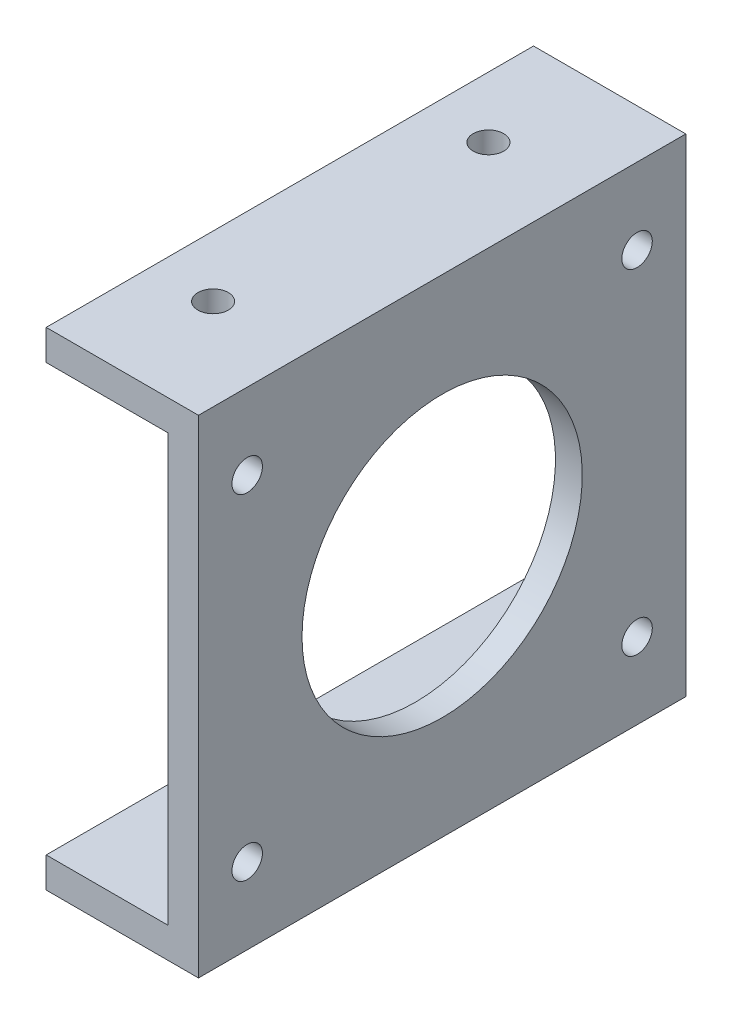
ISO-10303-21;
HEADER;
FILE_DESCRIPTION(('STEP AP214'),'2;1');
FILE_NAME('part.step','',(''),(''),'','','');
FILE_SCHEMA(('AUTOMOTIVE_DESIGN { 1 0 10303 214 1 1 1 1 }'));
ENDSEC;
DATA;
#1=APPLICATION_CONTEXT('core data for automotive mechanical design processes');
#2=APPLICATION_PROTOCOL_DEFINITION('international standard','automotive_design',2000,#1);
#3=PRODUCT_CONTEXT('',#1,'mechanical');
#4=PRODUCT('Part','Part','',(#3));
#5=PRODUCT_RELATED_PRODUCT_CATEGORY('part','',(#4));
#6=PRODUCT_DEFINITION_FORMATION('','',#4);
#7=PRODUCT_DEFINITION_CONTEXT('part definition',#1,'design');
#8=PRODUCT_DEFINITION('design','',#6,#7);
#9=PRODUCT_DEFINITION_SHAPE('','',#8);
#10=(LENGTH_UNIT() NAMED_UNIT(*) SI_UNIT(.MILLI.,.METRE.));
#11=(NAMED_UNIT(*) PLANE_ANGLE_UNIT() SI_UNIT($,.RADIAN.));
#12=(NAMED_UNIT(*) SI_UNIT($,.STERADIAN.) SOLID_ANGLE_UNIT());
#13=UNCERTAINTY_MEASURE_WITH_UNIT(LENGTH_MEASURE(1.E-05),#10,'distance_accuracy_value','');
#14=(GEOMETRIC_REPRESENTATION_CONTEXT(3) GLOBAL_UNCERTAINTY_ASSIGNED_CONTEXT((#13)) GLOBAL_UNIT_ASSIGNED_CONTEXT((#10,
#11,#12)) REPRESENTATION_CONTEXT('',''));
#15=CARTESIAN_POINT('',(0.,0.,0.));
#16=DIRECTION('',(0.,0.,1.));
#17=DIRECTION('',(1.,0.,0.));
#18=AXIS2_PLACEMENT_3D('',#15,#16,#17);
#19=CARTESIAN_POINT('',(0.,40.,80.));
#20=DIRECTION('',(1.,0.,0.));
#21=DIRECTION('',(0.,0.,-1.));
#22=AXIS2_PLACEMENT_3D('',#19,#20,#21);
#23=PLANE('',#22);
#24=DIRECTION('',(0.,-1.,0.));
#25=VECTOR('',#24,1.);
#26=CARTESIAN_POINT('',(0.,40.,0.));
#27=LINE('',#26,#25);
#28=CARTESIAN_POINT('',(0.,40.,0.));
#29=VERTEX_POINT('',#28);
#30=CARTESIAN_POINT('',(0.,35.,0.));
#31=VERTEX_POINT('',#30);
#32=EDGE_CURVE('E142',#29,#31,#27,.T.);
#33=ORIENTED_EDGE('',*,*,#32,.T.);
#34=DIRECTION('',(0.,0.,-1.));
#35=VECTOR('',#34,1.);
#36=CARTESIAN_POINT('',(0.,35.,80.));
#37=LINE('',#36,#35);
#38=CARTESIAN_POINT('',(0.,35.,80.));
#39=VERTEX_POINT('',#38);
#40=EDGE_CURVE('E49',#39,#31,#37,.T.);
#41=ORIENTED_EDGE('',*,*,#40,.F.);
#42=DIRECTION('',(0.,-1.,0.));
#43=VECTOR('',#42,1.);
#44=CARTESIAN_POINT('',(0.,40.,80.));
#45=LINE('',#44,#43);
#46=CARTESIAN_POINT('',(0.,40.,80.));
#47=VERTEX_POINT('',#46);
#48=EDGE_CURVE('E165',#47,#39,#45,.T.);
#49=ORIENTED_EDGE('',*,*,#48,.F.);
#50=DIRECTION('',(0.,0.,-1.));
#51=VECTOR('',#50,1.);
#52=CARTESIAN_POINT('',(0.,40.,80.));
#53=LINE('',#52,#51);
#54=EDGE_CURVE('E138',#47,#29,#53,.T.);
#55=ORIENTED_EDGE('',*,*,#54,.T.);
#56=EDGE_LOOP('',(#33,#41,#49,#55));
#57=FACE_BOUND('',#56,.T.);
#58=ADVANCED_FACE('F38',(#57),#23,.F.);
#59=CARTESIAN_POINT('',(0.,35.,80.));
#60=DIRECTION('',(0.,1.,0.));
#61=DIRECTION('',(0.,0.,1.));
#62=AXIS2_PLACEMENT_3D('',#59,#60,#61);
#63=PLANE('',#62);
#64=CARTESIAN_POINT('',(9.99999999999999,35.,17.4));
#65=DIRECTION('',(0.,1.,0.));
#66=DIRECTION('',(0.,0.,1.));
#67=AXIS2_PLACEMENT_3D('',#64,#65,#66);
#68=CIRCLE('',#67,2.49999999999999);
#69=CARTESIAN_POINT('',(9.99999999999999,35.,19.9));
#70=VERTEX_POINT('',#69);
#71=EDGE_CURVE('E238',#70,#70,#68,.T.);
#72=ORIENTED_EDGE('',*,*,#71,.T.);
#73=EDGE_LOOP('',(#72));
#74=FACE_BOUND('',#73,.T.);
#75=CARTESIAN_POINT('',(9.99999999999999,35.,62.6));
#76=DIRECTION('',(0.,1.,0.));
#77=DIRECTION('',(0.,0.,1.));
#78=AXIS2_PLACEMENT_3D('',#75,#76,#77);
#79=CIRCLE('',#78,2.49999999999999);
#80=CARTESIAN_POINT('',(9.99999999999999,35.,65.1));
#81=VERTEX_POINT('',#80);
#82=EDGE_CURVE('E42',#81,#81,#79,.T.);
#83=ORIENTED_EDGE('',*,*,#82,.T.);
#84=EDGE_LOOP('',(#83));
#85=FACE_BOUND('',#84,.T.);
#86=DIRECTION('',(1.,0.,0.));
#87=VECTOR('',#86,1.);
#88=CARTESIAN_POINT('',(0.,35.,0.));
#89=LINE('',#88,#87);
#90=CARTESIAN_POINT('',(20.,35.,0.));
#91=VERTEX_POINT('',#90);
#92=EDGE_CURVE('E146',#31,#91,#89,.T.);
#93=ORIENTED_EDGE('',*,*,#92,.T.);
#94=DIRECTION('',(0.,0.,-1.));
#95=VECTOR('',#94,1.);
#96=CARTESIAN_POINT('',(20.,35.,80.));
#97=LINE('',#96,#95);
#98=CARTESIAN_POINT('',(20.,35.,80.));
#99=VERTEX_POINT('',#98);
#100=EDGE_CURVE('E180',#99,#91,#97,.T.);
#101=ORIENTED_EDGE('',*,*,#100,.F.);
#102=DIRECTION('',(1.,0.,0.));
#103=VECTOR('',#102,1.);
#104=CARTESIAN_POINT('',(0.,35.,80.));
#105=LINE('',#104,#103);
#106=EDGE_CURVE('E101',#39,#99,#105,.T.);
#107=ORIENTED_EDGE('',*,*,#106,.F.);
#108=ORIENTED_EDGE('',*,*,#40,.T.);
#109=EDGE_LOOP('',(#93,#101,#107,#108));
#110=FACE_BOUND('',#109,.T.);
#111=ADVANCED_FACE('F186',(#74,#85,#110),#63,.F.);
#112=CARTESIAN_POINT('',(20.,35.,80.));
#113=DIRECTION('',(1.,0.,0.));
#114=DIRECTION('',(0.,1.,0.));
#115=AXIS2_PLACEMENT_3D('',#112,#113,#114);
#116=PLANE('',#115);
#117=CARTESIAN_POINT('',(20.,27.5,72.));
#118=DIRECTION('',(1.,0.,0.));
#119=DIRECTION('',(0.,1.,0.));
#120=AXIS2_PLACEMENT_3D('',#117,#118,#119);
#121=CIRCLE('',#120,2.49999999999999);
#122=CARTESIAN_POINT('',(20.,30.,72.));
#123=VERTEX_POINT('',#122);
#124=EDGE_CURVE('E278',#123,#123,#121,.T.);
#125=ORIENTED_EDGE('',*,*,#124,.T.);
#126=EDGE_LOOP('',(#125));
#127=FACE_BOUND('',#126,.T.);
#128=CARTESIAN_POINT('',(20.,27.5,8.));
#129=DIRECTION('',(1.,0.,0.));
#130=DIRECTION('',(0.,1.,0.));
#131=AXIS2_PLACEMENT_3D('',#128,#129,#130);
#132=CIRCLE('',#131,2.49999999999999);
#133=CARTESIAN_POINT('',(20.,30.,8.));
#134=VERTEX_POINT('',#133);
#135=EDGE_CURVE('E270',#134,#134,#132,.T.);
#136=ORIENTED_EDGE('',*,*,#135,.T.);
#137=EDGE_LOOP('',(#136));
#138=FACE_BOUND('',#137,.T.);
#139=CARTESIAN_POINT('',(20.,-27.5,7.99999999999999));
#140=DIRECTION('',(1.,0.,0.));
#141=DIRECTION('',(0.,1.,0.));
#142=AXIS2_PLACEMENT_3D('',#139,#140,#141);
#143=CIRCLE('',#142,2.49999999999999);
#144=CARTESIAN_POINT('',(20.,-25.,7.99999999999999));
#145=VERTEX_POINT('',#144);
#146=EDGE_CURVE('E262',#145,#145,#143,.T.);
#147=ORIENTED_EDGE('',*,*,#146,.T.);
#148=EDGE_LOOP('',(#147));
#149=FACE_BOUND('',#148,.T.);
#150=CARTESIAN_POINT('',(20.,-27.5,72.));
#151=DIRECTION('',(1.,0.,0.));
#152=DIRECTION('',(0.,1.,0.));
#153=AXIS2_PLACEMENT_3D('',#150,#151,#152);
#154=CIRCLE('',#153,2.49999999999999);
#155=CARTESIAN_POINT('',(20.,-25.,72.));
#156=VERTEX_POINT('',#155);
#157=EDGE_CURVE('E254',#156,#156,#154,.T.);
#158=ORIENTED_EDGE('',*,*,#157,.T.);
#159=EDGE_LOOP('',(#158));
#160=FACE_BOUND('',#159,.T.);
#161=CARTESIAN_POINT('',(20.,0.,40.));
#162=DIRECTION('',(-1.,0.,0.));
#163=DIRECTION('',(0.,-1.,0.));
#164=AXIS2_PLACEMENT_3D('',#161,#162,#163);
#165=CIRCLE('',#164,26.);
#166=CARTESIAN_POINT('',(20.,-26.,40.));
#167=VERTEX_POINT('',#166);
#168=EDGE_CURVE('E147',#167,#167,#165,.T.);
#169=ORIENTED_EDGE('',*,*,#168,.F.);
#170=EDGE_LOOP('',(#169));
#171=FACE_BOUND('',#170,.T.);
#172=DIRECTION('',(0.,-1.,0.));
#173=VECTOR('',#172,1.);
#174=CARTESIAN_POINT('',(20.,35.,0.));
#175=LINE('',#174,#173);
#176=CARTESIAN_POINT('',(20.,-35.,0.));
#177=VERTEX_POINT('',#176);
#178=EDGE_CURVE('E150',#91,#177,#175,.T.);
#179=ORIENTED_EDGE('',*,*,#178,.T.);
#180=DIRECTION('',(0.,0.,-1.));
#181=VECTOR('',#180,1.);
#182=CARTESIAN_POINT('',(20.,-35.,80.));
#183=LINE('',#182,#181);
#184=CARTESIAN_POINT('',(20.,-35.,80.));
#185=VERTEX_POINT('',#184);
#186=EDGE_CURVE('E176',#185,#177,#183,.T.);
#187=ORIENTED_EDGE('',*,*,#186,.F.);
#188=DIRECTION('',(0.,-1.,0.));
#189=VECTOR('',#188,1.);
#190=CARTESIAN_POINT('',(20.,35.,80.));
#191=LINE('',#190,#189);
#192=EDGE_CURVE('E205',#99,#185,#191,.T.);
#193=ORIENTED_EDGE('',*,*,#192,.F.);
#194=ORIENTED_EDGE('',*,*,#100,.T.);
#195=EDGE_LOOP('',(#179,#187,#193,#194));
#196=FACE_BOUND('',#195,.T.);
#197=ADVANCED_FACE('F197',(#127,#138,#149,#160,#171,#196),#116,.F.);
#198=CARTESIAN_POINT('',(20.,-35.,80.));
#199=DIRECTION('',(0.,-1.,0.));
#200=DIRECTION('',(0.,0.,-1.));
#201=AXIS2_PLACEMENT_3D('',#198,#199,#200);
#202=PLANE('',#201);
#203=CARTESIAN_POINT('',(9.99999999999999,-35.,17.4));
#204=DIRECTION('',(0.,-1.,0.));
#205=DIRECTION('',(0.,0.,-1.));
#206=AXIS2_PLACEMENT_3D('',#203,#204,#205);
#207=CIRCLE('',#206,2.49999999999999);
#208=CARTESIAN_POINT('',(9.99999999999999,-35.,14.9));
#209=VERTEX_POINT('',#208);
#210=EDGE_CURVE('E242',#209,#209,#207,.T.);
#211=ORIENTED_EDGE('',*,*,#210,.T.);
#212=EDGE_LOOP('',(#211));
#213=FACE_BOUND('',#212,.T.);
#214=CARTESIAN_POINT('',(9.99999999999999,-35.,62.6));
#215=DIRECTION('',(0.,-1.,0.));
#216=DIRECTION('',(0.,0.,-1.));
#217=AXIS2_PLACEMENT_3D('',#214,#215,#216);
#218=CIRCLE('',#217,2.49999999999999);
#219=CARTESIAN_POINT('',(9.99999999999999,-35.,60.1));
#220=VERTEX_POINT('',#219);
#221=EDGE_CURVE('E226',#220,#220,#218,.T.);
#222=ORIENTED_EDGE('',*,*,#221,.T.);
#223=EDGE_LOOP('',(#222));
#224=FACE_BOUND('',#223,.T.);
#225=DIRECTION('',(-1.,0.,0.));
#226=VECTOR('',#225,1.);
#227=CARTESIAN_POINT('',(20.,-35.,0.));
#228=LINE('',#227,#226);
#229=CARTESIAN_POINT('',(0.,-35.,0.));
#230=VERTEX_POINT('',#229);
#231=EDGE_CURVE('E153',#177,#230,#228,.T.);
#232=ORIENTED_EDGE('',*,*,#231,.T.);
#233=DIRECTION('',(0.,0.,-1.));
#234=VECTOR('',#233,1.);
#235=CARTESIAN_POINT('',(0.,-35.,80.));
#236=LINE('',#235,#234);
#237=CARTESIAN_POINT('',(0.,-35.,80.));
#238=VERTEX_POINT('',#237);
#239=EDGE_CURVE('E172',#238,#230,#236,.T.);
#240=ORIENTED_EDGE('',*,*,#239,.F.);
#241=DIRECTION('',(-1.,0.,0.));
#242=VECTOR('',#241,1.);
#243=CARTESIAN_POINT('',(20.,-35.,80.));
#244=LINE('',#243,#242);
#245=EDGE_CURVE('E203',#185,#238,#244,.T.);
#246=ORIENTED_EDGE('',*,*,#245,.F.);
#247=ORIENTED_EDGE('',*,*,#186,.T.);
#248=EDGE_LOOP('',(#232,#240,#246,#247));
#249=FACE_BOUND('',#248,.T.);
#250=ADVANCED_FACE('F201',(#213,#224,#249),#202,.F.);
#251=CARTESIAN_POINT('',(0.,-35.,80.));
#252=DIRECTION('',(1.,0.,0.));
#253=DIRECTION('',(0.,0.,-1.));
#254=AXIS2_PLACEMENT_3D('',#251,#252,#253);
#255=PLANE('',#254);
#256=DIRECTION('',(0.,-1.,0.));
#257=VECTOR('',#256,1.);
#258=CARTESIAN_POINT('',(0.,-35.,0.));
#259=LINE('',#258,#257);
#260=CARTESIAN_POINT('',(0.,-40.,0.));
#261=VERTEX_POINT('',#260);
#262=EDGE_CURVE('E156',#230,#261,#259,.T.);
#263=ORIENTED_EDGE('',*,*,#262,.T.);
#264=DIRECTION('',(0.,0.,-1.));
#265=VECTOR('',#264,1.);
#266=CARTESIAN_POINT('',(0.,-40.,80.));
#267=LINE('',#266,#265);
#268=CARTESIAN_POINT('',(0.,-40.,80.));
#269=VERTEX_POINT('',#268);
#270=EDGE_CURVE('E131',#269,#261,#267,.T.);
#271=ORIENTED_EDGE('',*,*,#270,.F.);
#272=DIRECTION('',(0.,-1.,0.));
#273=VECTOR('',#272,1.);
#274=CARTESIAN_POINT('',(0.,-35.,80.));
#275=LINE('',#274,#273);
#276=EDGE_CURVE('E120',#238,#269,#275,.T.);
#277=ORIENTED_EDGE('',*,*,#276,.F.);
#278=ORIENTED_EDGE('',*,*,#239,.T.);
#279=EDGE_LOOP('',(#263,#271,#277,#278));
#280=FACE_BOUND('',#279,.T.);
#281=ADVANCED_FACE('F331',(#280),#255,.F.);
#282=CARTESIAN_POINT('',(0.,-40.,80.));
#283=DIRECTION('',(0.,1.,0.));
#284=DIRECTION('',(-1.,0.,0.));
#285=AXIS2_PLACEMENT_3D('',#282,#283,#284);
#286=PLANE('',#285);
#287=CARTESIAN_POINT('',(9.99999999999999,-40.,17.4));
#288=DIRECTION('',(0.,1.,0.));
#289=DIRECTION('',(0.,0.,1.));
#290=AXIS2_PLACEMENT_3D('',#287,#288,#289);
#291=CIRCLE('',#290,2.49999999999999);
#292=CARTESIAN_POINT('',(9.99999999999999,-40.,19.9));
#293=VERTEX_POINT('',#292);
#294=EDGE_CURVE('E246',#293,#293,#291,.T.);
#295=ORIENTED_EDGE('',*,*,#294,.T.);
#296=EDGE_LOOP('',(#295));
#297=FACE_BOUND('',#296,.T.);
#298=CARTESIAN_POINT('',(9.99999999999999,-40.,62.6));
#299=DIRECTION('',(0.,1.,0.));
#300=DIRECTION('',(0.,0.,1.));
#301=AXIS2_PLACEMENT_3D('',#298,#299,#300);
#302=CIRCLE('',#301,2.49999999999999);
#303=CARTESIAN_POINT('',(9.99999999999999,-40.,65.1));
#304=VERTEX_POINT('',#303);
#305=EDGE_CURVE('E230',#304,#304,#302,.T.);
#306=ORIENTED_EDGE('',*,*,#305,.T.);
#307=EDGE_LOOP('',(#306));
#308=FACE_BOUND('',#307,.T.);
#309=DIRECTION('',(1.,0.,0.));
#310=VECTOR('',#309,1.);
#311=CARTESIAN_POINT('',(0.,-40.,0.));
#312=LINE('',#311,#310);
#313=CARTESIAN_POINT('',(25.,-40.,0.));
#314=VERTEX_POINT('',#313);
#315=EDGE_CURVE('E129',#261,#314,#312,.T.);
#316=ORIENTED_EDGE('',*,*,#315,.T.);
#317=DIRECTION('',(0.,0.,-1.));
#318=VECTOR('',#317,1.);
#319=CARTESIAN_POINT('',(25.,-40.,80.));
#320=LINE('',#319,#318);
#321=CARTESIAN_POINT('',(25.,-40.,80.));
#322=VERTEX_POINT('',#321);
#323=EDGE_CURVE('E126',#322,#314,#320,.T.);
#324=ORIENTED_EDGE('',*,*,#323,.F.);
#325=DIRECTION('',(1.,0.,0.));
#326=VECTOR('',#325,1.);
#327=CARTESIAN_POINT('',(0.,-40.,80.));
#328=LINE('',#327,#326);
#329=EDGE_CURVE('E114',#269,#322,#328,.T.);
#330=ORIENTED_EDGE('',*,*,#329,.F.);
#331=ORIENTED_EDGE('',*,*,#270,.T.);
#332=EDGE_LOOP('',(#316,#324,#330,#331));
#333=FACE_BOUND('',#332,.T.);
#334=ADVANCED_FACE('F127',(#297,#308,#333),#286,.F.);
#335=CARTESIAN_POINT('',(25.,-40.,80.));
#336=DIRECTION('',(-1.,0.,0.));
#337=DIRECTION('',(0.,0.,1.));
#338=AXIS2_PLACEMENT_3D('',#335,#336,#337);
#339=PLANE('',#338);
#340=CARTESIAN_POINT('',(25.,27.5,72.));
#341=DIRECTION('',(1.,0.,0.));
#342=DIRECTION('',(0.,0.,-1.));
#343=AXIS2_PLACEMENT_3D('',#340,#341,#342);
#344=CIRCLE('',#343,2.49999999999999);
#345=CARTESIAN_POINT('',(25.,27.5,69.5));
#346=VERTEX_POINT('',#345);
#347=EDGE_CURVE('E282',#346,#346,#344,.T.);
#348=ORIENTED_EDGE('',*,*,#347,.F.);
#349=EDGE_LOOP('',(#348));
#350=FACE_BOUND('',#349,.T.);
#351=CARTESIAN_POINT('',(25.,27.5,8.));
#352=DIRECTION('',(1.,0.,0.));
#353=DIRECTION('',(0.,0.,-1.));
#354=AXIS2_PLACEMENT_3D('',#351,#352,#353);
#355=CIRCLE('',#354,2.49999999999999);
#356=CARTESIAN_POINT('',(25.,27.5,5.50000000000001));
#357=VERTEX_POINT('',#356);
#358=EDGE_CURVE('E274',#357,#357,#355,.T.);
#359=ORIENTED_EDGE('',*,*,#358,.F.);
#360=EDGE_LOOP('',(#359));
#361=FACE_BOUND('',#360,.T.);
#362=CARTESIAN_POINT('',(25.,-27.5,7.99999999999999));
#363=DIRECTION('',(1.,0.,0.));
#364=DIRECTION('',(0.,0.,-1.));
#365=AXIS2_PLACEMENT_3D('',#362,#363,#364);
#366=CIRCLE('',#365,2.49999999999999);
#367=CARTESIAN_POINT('',(25.,-27.5,5.50000000000001));
#368=VERTEX_POINT('',#367);
#369=EDGE_CURVE('E266',#368,#368,#366,.T.);
#370=ORIENTED_EDGE('',*,*,#369,.F.);
#371=EDGE_LOOP('',(#370));
#372=FACE_BOUND('',#371,.T.);
#373=CARTESIAN_POINT('',(25.,-27.5,72.));
#374=DIRECTION('',(1.,0.,0.));
#375=DIRECTION('',(0.,0.,-1.));
#376=AXIS2_PLACEMENT_3D('',#373,#374,#375);
#377=CIRCLE('',#376,2.49999999999999);
#378=CARTESIAN_POINT('',(25.,-27.5,69.5));
#379=VERTEX_POINT('',#378);
#380=EDGE_CURVE('E258',#379,#379,#377,.T.);
#381=ORIENTED_EDGE('',*,*,#380,.F.);
#382=EDGE_LOOP('',(#381));
#383=FACE_BOUND('',#382,.T.);
#384=CARTESIAN_POINT('',(25.,0.,40.));
#385=DIRECTION('',(-1.,0.,0.));
#386=DIRECTION('',(0.,0.,1.));
#387=AXIS2_PLACEMENT_3D('',#384,#385,#386);
#388=CIRCLE('',#387,23.);
#389=CARTESIAN_POINT('',(25.,0.,63.));
#390=VERTEX_POINT('',#389);
#391=EDGE_CURVE('E218',#390,#390,#388,.F.);
#392=ORIENTED_EDGE('',*,*,#391,.F.);
#393=EDGE_LOOP('',(#392));
#394=FACE_BOUND('',#393,.T.);
#395=DIRECTION('',(0.,1.,0.));
#396=VECTOR('',#395,1.);
#397=CARTESIAN_POINT('',(25.,-40.,0.));
#398=LINE('',#397,#396);
#399=CARTESIAN_POINT('',(25.,40.,0.));
#400=VERTEX_POINT('',#399);
#401=EDGE_CURVE('E86',#314,#400,#398,.T.);
#402=ORIENTED_EDGE('',*,*,#401,.T.);
#403=DIRECTION('',(0.,0.,-1.));
#404=VECTOR('',#403,1.);
#405=CARTESIAN_POINT('',(25.,40.,80.));
#406=LINE('',#405,#404);
#407=CARTESIAN_POINT('',(25.,40.,80.));
#408=VERTEX_POINT('',#407);
#409=EDGE_CURVE('E132',#408,#400,#406,.T.);
#410=ORIENTED_EDGE('',*,*,#409,.F.);
#411=DIRECTION('',(0.,1.,0.));
#412=VECTOR('',#411,1.);
#413=CARTESIAN_POINT('',(25.,-40.,80.));
#414=LINE('',#413,#412);
#415=EDGE_CURVE('E118',#322,#408,#414,.T.);
#416=ORIENTED_EDGE('',*,*,#415,.F.);
#417=ORIENTED_EDGE('',*,*,#323,.T.);
#418=EDGE_LOOP('',(#402,#410,#416,#417));
#419=FACE_BOUND('',#418,.T.);
#420=ADVANCED_FACE('F134',(#350,#361,#372,#383,#394,#419),#339,.F.);
#421=CARTESIAN_POINT('',(25.,40.,80.));
#422=DIRECTION('',(0.,-1.,0.));
#423=DIRECTION('',(1.,0.,0.));
#424=AXIS2_PLACEMENT_3D('',#421,#422,#423);
#425=PLANE('',#424);
#426=CARTESIAN_POINT('',(9.99999999999999,40.,17.4));
#427=DIRECTION('',(0.,1.,0.));
#428=DIRECTION('',(0.,0.,1.));
#429=AXIS2_PLACEMENT_3D('',#426,#427,#428);
#430=CIRCLE('',#429,2.5);
#431=CARTESIAN_POINT('',(9.99999999999999,40.,19.9));
#432=VERTEX_POINT('',#431);
#433=EDGE_CURVE('E250',#432,#432,#430,.T.);
#434=ORIENTED_EDGE('',*,*,#433,.F.);
#435=EDGE_LOOP('',(#434));
#436=FACE_BOUND('',#435,.T.);
#437=CARTESIAN_POINT('',(9.99999999999999,40.,62.6));
#438=DIRECTION('',(0.,1.,0.));
#439=DIRECTION('',(0.,0.,1.));
#440=AXIS2_PLACEMENT_3D('',#437,#438,#439);
#441=CIRCLE('',#440,2.5);
#442=CARTESIAN_POINT('',(9.99999999999999,40.,65.1));
#443=VERTEX_POINT('',#442);
#444=EDGE_CURVE('E234',#443,#443,#441,.T.);
#445=ORIENTED_EDGE('',*,*,#444,.F.);
#446=EDGE_LOOP('',(#445));
#447=FACE_BOUND('',#446,.T.);
#448=DIRECTION('',(-1.,0.,0.));
#449=VECTOR('',#448,1.);
#450=CARTESIAN_POINT('',(25.,40.,0.));
#451=LINE('',#450,#449);
#452=EDGE_CURVE('E92',#400,#29,#451,.T.);
#453=ORIENTED_EDGE('',*,*,#452,.T.);
#454=ORIENTED_EDGE('',*,*,#54,.F.);
#455=DIRECTION('',(-1.,0.,0.));
#456=VECTOR('',#455,1.);
#457=CARTESIAN_POINT('',(25.,40.,80.));
#458=LINE('',#457,#456);
#459=EDGE_CURVE('E57',#408,#47,#458,.T.);
#460=ORIENTED_EDGE('',*,*,#459,.F.);
#461=ORIENTED_EDGE('',*,*,#409,.T.);
#462=EDGE_LOOP('',(#453,#454,#460,#461));
#463=FACE_BOUND('',#462,.T.);
#464=ADVANCED_FACE('F292',(#436,#447,#463),#425,.F.);
#465=CARTESIAN_POINT('',(0.,0.,80.));
#466=DIRECTION('',(0.,0.,1.));
#467=DIRECTION('',(1.,0.,0.));
#468=AXIS2_PLACEMENT_3D('',#465,#466,#467);
#469=PLANE('',#468);
#470=ORIENTED_EDGE('',*,*,#48,.T.);
#471=ORIENTED_EDGE('',*,*,#106,.T.);
#472=ORIENTED_EDGE('',*,*,#192,.T.);
#473=ORIENTED_EDGE('',*,*,#245,.T.);
#474=ORIENTED_EDGE('',*,*,#276,.T.);
#475=ORIENTED_EDGE('',*,*,#329,.T.);
#476=ORIENTED_EDGE('',*,*,#415,.T.);
#477=ORIENTED_EDGE('',*,*,#459,.T.);
#478=EDGE_LOOP('',(#470,#471,#472,#473,#474,#475,#476,#477));
#479=FACE_BOUND('',#478,.T.);
#480=ADVANCED_FACE('F116',(#479),#469,.T.);
#481=CARTESIAN_POINT('',(0.,0.,0.));
#482=DIRECTION('',(0.,0.,1.));
#483=DIRECTION('',(1.,0.,0.));
#484=AXIS2_PLACEMENT_3D('',#481,#482,#483);
#485=PLANE('',#484);
#486=ORIENTED_EDGE('',*,*,#32,.F.);
#487=ORIENTED_EDGE('',*,*,#452,.F.);
#488=ORIENTED_EDGE('',*,*,#401,.F.);
#489=ORIENTED_EDGE('',*,*,#315,.F.);
#490=ORIENTED_EDGE('',*,*,#262,.F.);
#491=ORIENTED_EDGE('',*,*,#231,.F.);
#492=ORIENTED_EDGE('',*,*,#178,.F.);
#493=ORIENTED_EDGE('',*,*,#92,.F.);
#494=EDGE_LOOP('',(#486,#487,#488,#489,#490,#491,#492,#493));
#495=FACE_BOUND('',#494,.T.);
#496=ADVANCED_FACE('F191',(#495),#485,.F.);
#497=CARTESIAN_POINT('',(20.6,0.,40.));
#498=DIRECTION('',(-1.,0.,0.));
#499=DIRECTION('',(0.,-1.,0.));
#500=AXIS2_PLACEMENT_3D('',#497,#498,#499);
#501=PLANE('',#500);
#502=CARTESIAN_POINT('',(20.6,0.,40.));
#503=DIRECTION('',(-1.,0.,0.));
#504=DIRECTION('',(0.,-1.,0.));
#505=AXIS2_PLACEMENT_3D('',#502,#503,#504);
#506=CIRCLE('',#505,23.);
#507=CARTESIAN_POINT('',(20.6,-23.,40.));
#508=VERTEX_POINT('',#507);
#509=EDGE_CURVE('E222',#508,#508,#506,.T.);
#510=ORIENTED_EDGE('',*,*,#509,.F.);
#511=EDGE_LOOP('',(#510));
#512=FACE_BOUND('',#511,.T.);
#513=CARTESIAN_POINT('',(20.6,0.,40.));
#514=DIRECTION('',(-1.,0.,0.));
#515=DIRECTION('',(0.,-1.,0.));
#516=AXIS2_PLACEMENT_3D('',#513,#514,#515);
#517=CIRCLE('',#516,25.4);
#518=CARTESIAN_POINT('',(20.6,-25.4,40.));
#519=VERTEX_POINT('',#518);
#520=EDGE_CURVE('E11',#519,#519,#517,.T.);
#521=ORIENTED_EDGE('',*,*,#520,.T.);
#522=EDGE_LOOP('',(#521));
#523=FACE_BOUND('',#522,.T.);
#524=ADVANCED_FACE('F309',(#512,#523),#501,.T.);
#525=CARTESIAN_POINT('',(20.,0.,40.));
#526=DIRECTION('',(-1.,0.,0.));
#527=DIRECTION('',(0.,-1.,0.));
#528=AXIS2_PLACEMENT_3D('',#525,#526,#527);
#529=TOROIDAL_SURFACE('',#528,25.4,0.6);
#530=ORIENTED_EDGE('',*,*,#168,.T.);
#531=EDGE_LOOP('',(#530));
#532=FACE_BOUND('',#531,.T.);
#533=ORIENTED_EDGE('',*,*,#520,.F.);
#534=EDGE_LOOP('',(#533));
#535=FACE_BOUND('',#534,.T.);
#536=ADVANCED_FACE('F40',(#532,#535),#529,.F.);
#537=CARTESIAN_POINT('',(90.0538238691624,0.,40.));
#538=DIRECTION('',(-1.,0.,0.));
#539=DIRECTION('',(0.,-1.,0.));
#540=AXIS2_PLACEMENT_3D('',#537,#538,#539);
#541=CYLINDRICAL_SURFACE('',#540,23.);
#542=ORIENTED_EDGE('',*,*,#391,.T.);
#543=EDGE_LOOP('',(#542));
#544=FACE_BOUND('',#543,.T.);
#545=ORIENTED_EDGE('',*,*,#509,.T.);
#546=EDGE_LOOP('',(#545));
#547=FACE_BOUND('',#546,.T.);
#548=ADVANCED_FACE('F302',(#544,#547),#541,.F.);
#549=CARTESIAN_POINT('',(9.99999999999999,40.,62.6));
#550=DIRECTION('',(0.,1.,0.));
#551=DIRECTION('',(0.,0.,1.));
#552=AXIS2_PLACEMENT_3D('',#549,#550,#551);
#553=CYLINDRICAL_SURFACE('',#552,2.49999999999999);
#554=ORIENTED_EDGE('',*,*,#444,.T.);
#555=EDGE_LOOP('',(#554));
#556=FACE_BOUND('',#555,.T.);
#557=ORIENTED_EDGE('',*,*,#82,.F.);
#558=EDGE_LOOP('',(#557));
#559=FACE_BOUND('',#558,.T.);
#560=ADVANCED_FACE('F305',(#556,#559),#553,.F.);
#561=ORIENTED_EDGE('',*,*,#305,.F.);
#562=EDGE_LOOP('',(#561));
#563=FACE_BOUND('',#562,.T.);
#564=ORIENTED_EDGE('',*,*,#221,.F.);
#565=EDGE_LOOP('',(#564));
#566=FACE_BOUND('',#565,.T.);
#567=ADVANCED_FACE('F346',(#563,#566),#553,.F.);
#568=CARTESIAN_POINT('',(9.99999999999999,40.,17.4));
#569=DIRECTION('',(0.,1.,0.));
#570=DIRECTION('',(0.,0.,1.));
#571=AXIS2_PLACEMENT_3D('',#568,#569,#570);
#572=CYLINDRICAL_SURFACE('',#571,2.49999999999999);
#573=ORIENTED_EDGE('',*,*,#433,.T.);
#574=EDGE_LOOP('',(#573));
#575=FACE_BOUND('',#574,.T.);
#576=ORIENTED_EDGE('',*,*,#71,.F.);
#577=EDGE_LOOP('',(#576));
#578=FACE_BOUND('',#577,.T.);
#579=ADVANCED_FACE('F349',(#575,#578),#572,.F.);
#580=ORIENTED_EDGE('',*,*,#294,.F.);
#581=EDGE_LOOP('',(#580));
#582=FACE_BOUND('',#581,.T.);
#583=ORIENTED_EDGE('',*,*,#210,.F.);
#584=EDGE_LOOP('',(#583));
#585=FACE_BOUND('',#584,.T.);
#586=ADVANCED_FACE('F353',(#582,#585),#572,.F.);
#587=CARTESIAN_POINT('',(25.,-27.5,72.));
#588=DIRECTION('',(1.,0.,0.));
#589=DIRECTION('',(0.,0.,-1.));
#590=AXIS2_PLACEMENT_3D('',#587,#588,#589);
#591=CYLINDRICAL_SURFACE('',#590,2.49999999999999);
#592=ORIENTED_EDGE('',*,*,#380,.T.);
#593=EDGE_LOOP('',(#592));
#594=FACE_BOUND('',#593,.T.);
#595=ORIENTED_EDGE('',*,*,#157,.F.);
#596=EDGE_LOOP('',(#595));
#597=FACE_BOUND('',#596,.T.);
#598=ADVANCED_FACE('F355',(#594,#597),#591,.F.);
#599=CARTESIAN_POINT('',(25.,-27.5,7.99999999999999));
#600=DIRECTION('',(1.,0.,0.));
#601=DIRECTION('',(0.,0.,-1.));
#602=AXIS2_PLACEMENT_3D('',#599,#600,#601);
#603=CYLINDRICAL_SURFACE('',#602,2.49999999999999);
#604=ORIENTED_EDGE('',*,*,#369,.T.);
#605=EDGE_LOOP('',(#604));
#606=FACE_BOUND('',#605,.T.);
#607=ORIENTED_EDGE('',*,*,#146,.F.);
#608=EDGE_LOOP('',(#607));
#609=FACE_BOUND('',#608,.T.);
#610=ADVANCED_FACE('F358',(#606,#609),#603,.F.);
#611=CARTESIAN_POINT('',(25.,27.5,8.));
#612=DIRECTION('',(1.,0.,0.));
#613=DIRECTION('',(0.,0.,-1.));
#614=AXIS2_PLACEMENT_3D('',#611,#612,#613);
#615=CYLINDRICAL_SURFACE('',#614,2.49999999999999);
#616=ORIENTED_EDGE('',*,*,#358,.T.);
#617=EDGE_LOOP('',(#616));
#618=FACE_BOUND('',#617,.T.);
#619=ORIENTED_EDGE('',*,*,#135,.F.);
#620=EDGE_LOOP('',(#619));
#621=FACE_BOUND('',#620,.T.);
#622=ADVANCED_FACE('F362',(#618,#621),#615,.F.);
#623=CARTESIAN_POINT('',(25.,27.5,72.));
#624=DIRECTION('',(1.,0.,0.));
#625=DIRECTION('',(0.,0.,-1.));
#626=AXIS2_PLACEMENT_3D('',#623,#624,#625);
#627=CYLINDRICAL_SURFACE('',#626,2.49999999999999);
#628=ORIENTED_EDGE('',*,*,#347,.T.);
#629=EDGE_LOOP('',(#628));
#630=FACE_BOUND('',#629,.T.);
#631=ORIENTED_EDGE('',*,*,#124,.F.);
#632=EDGE_LOOP('',(#631));
#633=FACE_BOUND('',#632,.T.);
#634=ADVANCED_FACE('F287',(#630,#633),#627,.F.);
#635=CLOSED_SHELL('',(#58,#111,#197,#250,#281,#334,#420,#464,#480,#496,#524,#536,#548,#560,#567,
#579,#586,#598,#610,#622,#634));
#636=MANIFOLD_SOLID_BREP('B2',#635);
#637=ADVANCED_BREP_SHAPE_REPRESENTATION('',(#18,#636),#14);
#638=SHAPE_DEFINITION_REPRESENTATION(#9,#637);
ENDSEC;
END-ISO-10303-21;
